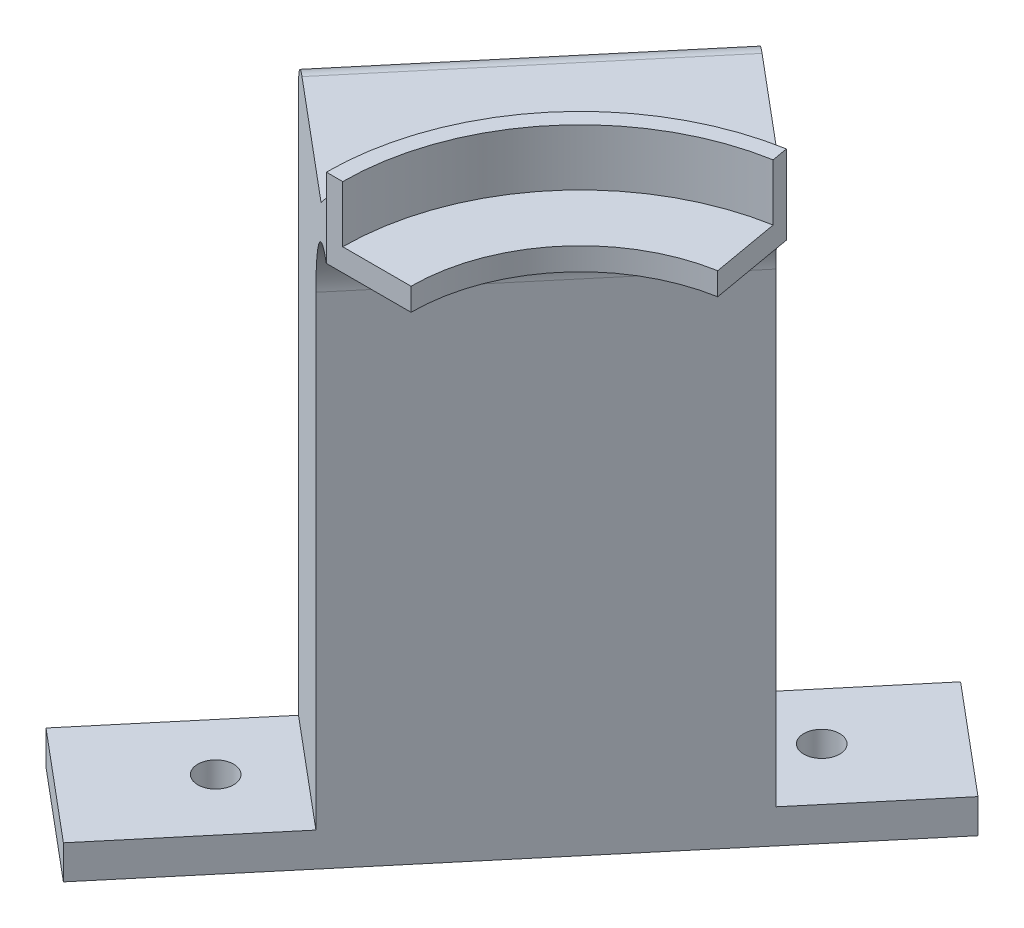
ISO-10303-21;
HEADER;
FILE_DESCRIPTION(('STEP AP214'),'2;1');
FILE_NAME('part.step','',(''),(''),'','','');
FILE_SCHEMA(('AUTOMOTIVE_DESIGN { 1 0 10303 214 1 1 1 1 }'));
ENDSEC;
DATA;
#1=APPLICATION_CONTEXT('core data for automotive mechanical design processes');
#2=APPLICATION_PROTOCOL_DEFINITION('international standard','automotive_design',2000,#1);
#3=PRODUCT_CONTEXT('',#1,'mechanical');
#4=PRODUCT('Part','Part','',(#3));
#5=PRODUCT_RELATED_PRODUCT_CATEGORY('part','',(#4));
#6=PRODUCT_DEFINITION_FORMATION('','',#4);
#7=PRODUCT_DEFINITION_CONTEXT('part definition',#1,'design');
#8=PRODUCT_DEFINITION('design','',#6,#7);
#9=PRODUCT_DEFINITION_SHAPE('','',#8);
#10=(LENGTH_UNIT() NAMED_UNIT(*) SI_UNIT(.MILLI.,.METRE.));
#11=(NAMED_UNIT(*) PLANE_ANGLE_UNIT() SI_UNIT($,.RADIAN.));
#12=(NAMED_UNIT(*) SI_UNIT($,.STERADIAN.) SOLID_ANGLE_UNIT());
#13=UNCERTAINTY_MEASURE_WITH_UNIT(LENGTH_MEASURE(1.E-05),#10,'distance_accuracy_value','');
#14=(GEOMETRIC_REPRESENTATION_CONTEXT(3) GLOBAL_UNCERTAINTY_ASSIGNED_CONTEXT((#13)) GLOBAL_UNIT_ASSIGNED_CONTEXT((#10,
#11,#12)) REPRESENTATION_CONTEXT('',''));
#15=CARTESIAN_POINT('',(0.,0.,0.));
#16=DIRECTION('',(0.,0.,1.));
#17=DIRECTION('',(1.,0.,0.));
#18=AXIS2_PLACEMENT_3D('',#15,#16,#17);
#19=CARTESIAN_POINT('',(-45.,101.490947660166,0.));
#20=DIRECTION('',(-0.642787609686541,0.,0.766044443118977));
#21=DIRECTION('',(0.766044443118977,0.,0.642787609686541));
#22=AXIS2_PLACEMENT_3D('',#19,#20,#21);
#23=PLANE('',#22);
#24=DIRECTION('',(0.,-1.,0.));
#25=VECTOR('',#24,1.);
#26=CARTESIAN_POINT('',(-75.6417777247591,101.490947660166,-25.7115043874616));
#27=LINE('',#26,#25);
#28=CARTESIAN_POINT('',(-75.6417777247591,-1.,-25.7115043874616));
#29=VERTEX_POINT('',#28);
#30=CARTESIAN_POINT('',(-75.6417777247591,-97.5,-25.7115043874616));
#31=VERTEX_POINT('',#30);
#32=EDGE_CURVE('E245',#29,#31,#27,.T.);
#33=ORIENTED_EDGE('',*,*,#32,.T.);
#34=DIRECTION('',(-0.766044443118977,0.,-0.642787609686541));
#35=VECTOR('',#34,1.);
#36=CARTESIAN_POINT('',(-56.4906666467847,-97.5,-9.64181414529811));
#37=LINE('',#36,#35);
#38=CARTESIAN_POINT('',(-56.4906666467847,-97.5,-9.64181414529811));
#39=VERTEX_POINT('',#38);
#40=EDGE_CURVE('E192',#39,#31,#37,.T.);
#41=ORIENTED_EDGE('',*,*,#40,.F.);
#42=DIRECTION('',(0.,1.,0.));
#43=VECTOR('',#42,1.);
#44=CARTESIAN_POINT('',(-56.4906666467847,-103.5,-9.64181414529812));
#45=LINE('',#44,#43);
#46=CARTESIAN_POINT('',(-56.4906666467847,-15.,-9.64181414529812));
#47=VERTEX_POINT('',#46);
#48=EDGE_CURVE('E233',#39,#47,#45,.T.);
#49=ORIENTED_EDGE('',*,*,#48,.T.);
#50=CARTESIAN_POINT('',(-45.,-15.,0.));
#51=DIRECTION('',(-0.642787609686541,0.,0.766044443118977));
#52=DIRECTION('',(0.766044443118977,0.,0.642787609686541));
#53=AXIS2_PLACEMENT_3D('',#50,#51,#52);
#54=CIRCLE('',#53,15.);
#55=CARTESIAN_POINT('',(-45.,0.,0.));
#56=VERTEX_POINT('',#55);
#57=EDGE_CURVE('E326',#47,#56,#54,.F.);
#58=ORIENTED_EDGE('',*,*,#57,.T.);
#59=DIRECTION('',(0.,-1.,0.));
#60=VECTOR('',#59,1.);
#61=CARTESIAN_POINT('',(-45.,101.490947660166,0.));
#62=LINE('',#61,#60);
#63=CARTESIAN_POINT('',(-45.,10.0000000000001,0.));
#64=VERTEX_POINT('',#63);
#65=EDGE_CURVE('E79',#64,#56,#62,.T.);
#66=ORIENTED_EDGE('',*,*,#65,.F.);
#67=CARTESIAN_POINT('',(-45.,10.0000000000001,0.));
#68=CARTESIAN_POINT('',(-45.4880326285549,9.51193638448727,-0.409507998622885));
#69=CARTESIAN_POINT('',(-45.9740151780585,9.020395405976,-0.817295776669948));
#70=CARTESIAN_POINT('',(-46.942224934509,8.03114810288744,-1.62972022620982));
#71=CARTESIAN_POINT('',(-47.42445242808,7.53344225653954,-2.03435713820875));
#72=CARTESIAN_POINT('',(-48.3855652758212,6.53258613459932,-2.84082657426816));
#73=CARTESIAN_POINT('',(-48.8644506767905,6.0294359354965,-3.24265913759772));
#74=CARTESIAN_POINT('',(-49.8192382605808,5.01823586629704,-4.04382104700881));
#75=CARTESIAN_POINT('',(-50.2951402107248,4.51018562170407,-4.44315019785117));
#76=CARTESIAN_POINT('',(-50.7696896198008,4.,-4.84134443198228));
#77=B_SPLINE_CURVE_WITH_KNOTS('',3,(#67,#68,#69,#70,#71,#72,#73,#74,#75,#76),.UNSPECIFIED.,.F.,
.F.,(4,2,2,2,4),(0.,2.4076095624587,4.81503351392388,7.22242368650531,9.62999933039969),.UNSPECIFIED.);
#78=CARTESIAN_POINT('',(-50.7696896198009,4.,-4.84134443198228));
#79=VERTEX_POINT('',#78);
#80=EDGE_CURVE('E54',#64,#79,#77,.T.);
#81=ORIENTED_EDGE('',*,*,#80,.T.);
#82=DIRECTION('',(-0.766044443118977,0.,-0.642787609686541));
#83=VECTOR('',#82,1.);
#84=CARTESIAN_POINT('',(-45.,4.,0.));
#85=LINE('',#84,#83);
#86=CARTESIAN_POINT('',(-71.8115555091642,4.,-22.4975663390289));
#87=VERTEX_POINT('',#86);
#88=EDGE_CURVE('E82',#79,#87,#85,.T.);
#89=ORIENTED_EDGE('',*,*,#88,.T.);
#90=CARTESIAN_POINT('',(-71.8115555091642,-1.,-22.4975663390289));
#91=DIRECTION('',(-0.642787609686541,0.,0.766044443118977));
#92=DIRECTION('',(0.766044443118977,0.,0.642787609686541));
#93=AXIS2_PLACEMENT_3D('',#90,#91,#92);
#94=CIRCLE('',#93,5.);
#95=EDGE_CURVE('E343',#87,#29,#94,.T.);
#96=ORIENTED_EDGE('',*,*,#95,.T.);
#97=EDGE_LOOP('',(#33,#41,#49,#58,#66,#81,#89,#96));
#98=FACE_BOUND('',#97,.T.);
#99=ADVANCED_FACE('F42',(#98),#23,.T.);
#100=CARTESIAN_POINT('',(-38.4559457197708,101.490947660166,-70.027853273011));
#101=DIRECTION('',(0.642787609686541,0.,-0.766044443118977));
#102=DIRECTION('',(-0.766044443118976,0.,-0.642787609686541));
#103=AXIS2_PLACEMENT_3D('',#100,#101,#102);
#104=PLANE('',#103);
#105=DIRECTION('',(0.,1.,0.));
#106=VECTOR('',#105,1.);
#107=CARTESIAN_POINT('',(-19.3048346417964,-103.5,-53.9581630308475));
#108=LINE('',#107,#106);
#109=CARTESIAN_POINT('',(-19.3048346417964,-97.5,-53.9581630308475));
#110=VERTEX_POINT('',#109);
#111=CARTESIAN_POINT('',(-19.3048346417964,-15.,-53.9581630308475));
#112=VERTEX_POINT('',#111);
#113=EDGE_CURVE('E236',#110,#112,#108,.T.);
#114=ORIENTED_EDGE('',*,*,#113,.F.);
#115=DIRECTION('',(0.766044443118976,0.,0.642787609686541));
#116=VECTOR('',#115,1.);
#117=CARTESIAN_POINT('',(-19.3048346417964,-97.5,-53.9581630308475));
#118=LINE('',#117,#116);
#119=CARTESIAN_POINT('',(-38.4559457197708,-97.5,-70.027853273011));
#120=VERTEX_POINT('',#119);
#121=EDGE_CURVE('E198',#120,#110,#118,.T.);
#122=ORIENTED_EDGE('',*,*,#121,.F.);
#123=DIRECTION('',(0.,-1.,0.));
#124=VECTOR('',#123,1.);
#125=CARTESIAN_POINT('',(-38.4559457197708,101.490947660166,-70.027853273011));
#126=LINE('',#125,#124);
#127=CARTESIAN_POINT('',(-38.4559457197708,-1.,-70.027853273011));
#128=VERTEX_POINT('',#127);
#129=EDGE_CURVE('E248',#128,#120,#126,.T.);
#130=ORIENTED_EDGE('',*,*,#129,.F.);
#131=CARTESIAN_POINT('',(-34.6257235041759,-1.,-66.8139152245783));
#132=DIRECTION('',(0.642787609686541,0.,-0.766044443118977));
#133=DIRECTION('',(-0.766044443118976,0.,-0.642787609686541));
#134=AXIS2_PLACEMENT_3D('',#131,#132,#133);
#135=CIRCLE('',#134,5.);
#136=CARTESIAN_POINT('',(-34.6257235041759,4.,-66.8139152245783));
#137=VERTEX_POINT('',#136);
#138=EDGE_CURVE('E337',#128,#137,#135,.T.);
#139=ORIENTED_EDGE('',*,*,#138,.T.);
#140=DIRECTION('',(0.766044443118976,0.,0.642787609686541));
#141=VECTOR('',#140,1.);
#142=CARTESIAN_POINT('',(-38.4559457197708,4.,-70.027853273011));
#143=LINE('',#142,#141);
#144=CARTESIAN_POINT('',(-13.5838576148126,4.,-49.1576933175317));
#145=VERTEX_POINT('',#144);
#146=EDGE_CURVE('E239',#137,#145,#143,.T.);
#147=ORIENTED_EDGE('',*,*,#146,.T.);
#148=CARTESIAN_POINT('',(-13.5838576148126,4.,-49.1576933175317));
#149=CARTESIAN_POINT('',(-13.1093082057365,4.51018562170407,-48.7594990834006));
#150=CARTESIAN_POINT('',(-12.6334062555925,5.01823586629704,-48.3601699325582));
#151=CARTESIAN_POINT('',(-11.6786186718022,6.0294359354965,-47.5590080231471));
#152=CARTESIAN_POINT('',(-11.1997332708329,6.53258613459932,-47.1571754598176));
#153=CARTESIAN_POINT('',(-10.2386204230917,7.53344225653954,-46.3507060237581));
#154=CARTESIAN_POINT('',(-9.75639292952074,8.03114810288743,-45.9460691117592));
#155=CARTESIAN_POINT('',(-8.78818317307022,9.020395405976,-45.1336446622193));
#156=CARTESIAN_POINT('',(-8.30220062356662,9.51193638448727,-44.7258568841723));
#157=CARTESIAN_POINT('',(-7.81416799501174,10.0000000000001,-44.3163488855494));
#158=B_SPLINE_CURVE_WITH_KNOTS('',3,(#148,#149,#150,#151,#152,#153,#154,#155,#156,#157),
.UNSPECIFIED.,.F.,.F.,(4,2,2,2,4),(0.,2.40757564389438,4.81496581647581,7.22238976794098,
9.62999933039969),.UNSPECIFIED.);
#159=CARTESIAN_POINT('',(-7.81416799501174,10.0000000000001,-44.3163488855494));
#160=VERTEX_POINT('',#159);
#161=EDGE_CURVE('E11',#145,#160,#158,.T.);
#162=ORIENTED_EDGE('',*,*,#161,.T.);
#163=DIRECTION('',(0.,-1.,0.));
#164=VECTOR('',#163,1.);
#165=CARTESIAN_POINT('',(-7.81416799501174,101.490947660166,-44.3163488855494));
#166=LINE('',#165,#164);
#167=CARTESIAN_POINT('',(-7.81416799501174,0.,-44.3163488855494));
#168=VERTEX_POINT('',#167);
#169=EDGE_CURVE('E62',#160,#168,#166,.T.);
#170=ORIENTED_EDGE('',*,*,#169,.T.);
#171=CARTESIAN_POINT('',(-7.81416799501173,-15.,-44.3163488855494));
#172=DIRECTION('',(0.642787609686541,0.,-0.766044443118977));
#173=DIRECTION('',(-0.766044443118976,0.,-0.642787609686541));
#174=AXIS2_PLACEMENT_3D('',#171,#172,#173);
#175=CIRCLE('',#174,15.);
#176=EDGE_CURVE('E329',#168,#112,#175,.F.);
#177=ORIENTED_EDGE('',*,*,#176,.T.);
#178=EDGE_LOOP('',(#114,#122,#130,#139,#147,#162,#170,#177));
#179=FACE_BOUND('',#178,.T.);
#180=ADVANCED_FACE('F367',(#179),#104,.T.);
#181=CARTESIAN_POINT('',(0.,0.,0.));
#182=DIRECTION('',(0.,1.,0.));
#183=DIRECTION('',(0.,0.,1.));
#184=AXIS2_PLACEMENT_3D('',#181,#182,#183);
#185=PLANE('',#184);
#186=DIRECTION('',(-1.,0.,0.));
#187=VECTOR('',#186,1.);
#188=CARTESIAN_POINT('',(0.,0.,0.));
#189=LINE('',#188,#187);
#190=CARTESIAN_POINT('',(-30.,0.,0.));
#191=VERTEX_POINT('',#190);
#192=EDGE_CURVE('E289',#191,#56,#189,.T.);
#193=ORIENTED_EDGE('',*,*,#192,.T.);
#194=DIRECTION('',(-0.642787609686541,0.,0.766044443118977));
#195=VECTOR('',#194,1.);
#196=CARTESIAN_POINT('',(-7.81416799501173,0.,-44.3163488855494));
#197=LINE('',#196,#195);
#198=EDGE_CURVE('E323',#56,#168,#197,.F.);
#199=ORIENTED_EDGE('',*,*,#198,.T.);
#200=DIRECTION('',(-0.173648177666928,0.,-0.984807753012209));
#201=VECTOR('',#200,1.);
#202=CARTESIAN_POINT('',(0.,0.,0.));
#203=LINE('',#202,#201);
#204=CARTESIAN_POINT('',(-5.20944533000783,0.,-29.5442325903663));
#205=VERTEX_POINT('',#204);
#206=EDGE_CURVE('E301',#205,#168,#203,.T.);
#207=ORIENTED_EDGE('',*,*,#206,.F.);
#208=CARTESIAN_POINT('',(0.,0.,0.));
#209=DIRECTION('',(0.,1.,0.));
#210=DIRECTION('',(0.,0.,1.));
#211=AXIS2_PLACEMENT_3D('',#208,#209,#210);
#212=CIRCLE('',#211,30.);
#213=EDGE_CURVE('E283',#205,#191,#212,.T.);
#214=ORIENTED_EDGE('',*,*,#213,.T.);
#215=EDGE_LOOP('',(#193,#199,#207,#214));
#216=FACE_BOUND('',#215,.T.);
#217=ADVANCED_FACE('F372',(#216),#185,.F.);
#218=CARTESIAN_POINT('',(0.,4.,0.));
#219=DIRECTION('',(0.,1.,0.));
#220=DIRECTION('',(0.,0.,1.));
#221=AXIS2_PLACEMENT_3D('',#218,#219,#220);
#222=PLANE('',#221);
#223=DIRECTION('',(-0.173648177666928,0.,-0.984807753012209));
#224=VECTOR('',#223,1.);
#225=CARTESIAN_POINT('',(0.,4.,0.));
#226=LINE('',#225,#224);
#227=CARTESIAN_POINT('',(-5.20944533000783,4.,-29.5442325903663));
#228=VERTEX_POINT('',#227);
#229=CARTESIAN_POINT('',(-7.31058827977765,4.,-41.460406401814));
#230=VERTEX_POINT('',#229);
#231=EDGE_CURVE('E288',#228,#230,#226,.T.);
#232=ORIENTED_EDGE('',*,*,#231,.T.);
#233=CARTESIAN_POINT('',(0.,4.,0.));
#234=DIRECTION('',(0.,1.,0.));
#235=DIRECTION('',(0.,0.,1.));
#236=AXIS2_PLACEMENT_3D('',#233,#234,#235);
#237=CIRCLE('',#236,42.1);
#238=CARTESIAN_POINT('',(-42.1,4.,0.));
#239=VERTEX_POINT('',#238);
#240=EDGE_CURVE('E280',#239,#230,#237,.F.);
#241=ORIENTED_EDGE('',*,*,#240,.F.);
#242=DIRECTION('',(-1.,0.,0.));
#243=VECTOR('',#242,1.);
#244=CARTESIAN_POINT('',(0.,4.,0.));
#245=LINE('',#244,#243);
#246=CARTESIAN_POINT('',(-30.,4.,0.));
#247=VERTEX_POINT('',#246);
#248=EDGE_CURVE('E293',#247,#239,#245,.T.);
#249=ORIENTED_EDGE('',*,*,#248,.F.);
#250=CARTESIAN_POINT('',(0.,4.,0.));
#251=DIRECTION('',(0.,1.,0.));
#252=DIRECTION('',(0.,0.,1.));
#253=AXIS2_PLACEMENT_3D('',#250,#251,#252);
#254=CIRCLE('',#253,30.);
#255=EDGE_CURVE('E284',#228,#247,#254,.T.);
#256=ORIENTED_EDGE('',*,*,#255,.F.);
#257=EDGE_LOOP('',(#232,#241,#249,#256));
#258=FACE_BOUND('',#257,.T.);
#259=ADVANCED_FACE('F387',(#258),#222,.T.);
#260=CARTESIAN_POINT('',(0.,4.,0.));
#261=DIRECTION('',(0.,-1.,0.));
#262=DIRECTION('',(0.,0.,-1.));
#263=AXIS2_PLACEMENT_3D('',#260,#261,#262);
#264=CYLINDRICAL_SURFACE('',#263,30.);
#265=ORIENTED_EDGE('',*,*,#213,.F.);
#266=DIRECTION('',(0.,-1.,0.));
#267=VECTOR('',#266,1.);
#268=CARTESIAN_POINT('',(-5.20944533000783,4.,-29.5442325903663));
#269=LINE('',#268,#267);
#270=EDGE_CURVE('E316',#228,#205,#269,.T.);
#271=ORIENTED_EDGE('',*,*,#270,.F.);
#272=ORIENTED_EDGE('',*,*,#255,.T.);
#273=DIRECTION('',(0.,-1.,0.));
#274=VECTOR('',#273,1.);
#275=CARTESIAN_POINT('',(-30.,4.,0.));
#276=LINE('',#275,#274);
#277=EDGE_CURVE('E297',#247,#191,#276,.T.);
#278=ORIENTED_EDGE('',*,*,#277,.T.);
#279=EDGE_LOOP('',(#265,#271,#272,#278));
#280=FACE_BOUND('',#279,.T.);
#281=ADVANCED_FACE('F390',(#280),#264,.F.);
#282=CARTESIAN_POINT('',(0.,4.,0.));
#283=DIRECTION('',(-0.984807753012209,0.,0.173648177666928));
#284=DIRECTION('',(0.173648177666928,0.,0.984807753012209));
#285=AXIS2_PLACEMENT_3D('',#282,#283,#284);
#286=PLANE('',#285);
#287=ORIENTED_EDGE('',*,*,#206,.T.);
#288=ORIENTED_EDGE('',*,*,#169,.F.);
#289=DIRECTION('',(0.,-1.,0.));
#290=VECTOR('',#289,1.);
#291=CARTESIAN_POINT('',(-7.81416799501174,4.,-44.3163488855494));
#292=LINE('',#291,#290);
#293=CARTESIAN_POINT('',(-7.81416799501174,14.,-44.3163488855494));
#294=VERTEX_POINT('',#293);
#295=EDGE_CURVE('E313',#294,#160,#292,.T.);
#296=ORIENTED_EDGE('',*,*,#295,.F.);
#297=DIRECTION('',(-0.173648177666928,0.,-0.984807753012209));
#298=VECTOR('',#297,1.);
#299=CARTESIAN_POINT('',(0.,14.,0.));
#300=LINE('',#299,#298);
#301=CARTESIAN_POINT('',(-7.31058827977765,14.,-41.460406401814));
#302=VERTEX_POINT('',#301);
#303=EDGE_CURVE('E256',#302,#294,#300,.T.);
#304=ORIENTED_EDGE('',*,*,#303,.F.);
#305=DIRECTION('',(0.,-1.,0.));
#306=VECTOR('',#305,1.);
#307=CARTESIAN_POINT('',(-7.31058827977765,14.,-41.460406401814));
#308=LINE('',#307,#306);
#309=EDGE_CURVE('E272',#302,#230,#308,.T.);
#310=ORIENTED_EDGE('',*,*,#309,.T.);
#311=ORIENTED_EDGE('',*,*,#231,.F.);
#312=ORIENTED_EDGE('',*,*,#270,.T.);
#313=EDGE_LOOP('',(#287,#288,#296,#304,#310,#311,#312));
#314=FACE_BOUND('',#313,.T.);
#315=ADVANCED_FACE('F401',(#314),#286,.F.);
#316=CARTESIAN_POINT('',(0.,4.,0.));
#317=DIRECTION('',(0.,-1.,0.));
#318=DIRECTION('',(0.,0.,-1.));
#319=AXIS2_PLACEMENT_3D('',#316,#317,#318);
#320=CYLINDRICAL_SURFACE('',#319,45.);
#321=ORIENTED_EDGE('',*,*,#295,.T.);
#322=CARTESIAN_POINT('',(0.,10.0000000000001,0.));
#323=DIRECTION('',(0.,1.,0.));
#324=DIRECTION('',(0.,0.,1.));
#325=AXIS2_PLACEMENT_3D('',#322,#323,#324);
#326=CIRCLE('',#325,45.);
#327=EDGE_CURVE('E346',#160,#64,#326,.T.);
#328=ORIENTED_EDGE('',*,*,#327,.T.);
#329=DIRECTION('',(0.,-1.,0.));
#330=VECTOR('',#329,1.);
#331=CARTESIAN_POINT('',(-45.,4.,0.));
#332=LINE('',#331,#330);
#333=CARTESIAN_POINT('',(-45.,14.,0.));
#334=VERTEX_POINT('',#333);
#335=EDGE_CURVE('E309',#334,#64,#332,.T.);
#336=ORIENTED_EDGE('',*,*,#335,.F.);
#337=CARTESIAN_POINT('',(0.,14.,0.));
#338=DIRECTION('',(0.,1.,0.));
#339=DIRECTION('',(0.,0.,1.));
#340=AXIS2_PLACEMENT_3D('',#337,#338,#339);
#341=CIRCLE('',#340,45.);
#342=EDGE_CURVE('E260',#294,#334,#341,.T.);
#343=ORIENTED_EDGE('',*,*,#342,.F.);
#344=EDGE_LOOP('',(#321,#328,#336,#343));
#345=FACE_BOUND('',#344,.T.);
#346=ADVANCED_FACE('F397',(#345),#320,.T.);
#347=CARTESIAN_POINT('',(0.,4.,0.));
#348=DIRECTION('',(0.,0.,1.));
#349=DIRECTION('',(1.,0.,0.));
#350=AXIS2_PLACEMENT_3D('',#347,#348,#349);
#351=PLANE('',#350);
#352=ORIENTED_EDGE('',*,*,#248,.T.);
#353=DIRECTION('',(0.,-1.,0.));
#354=VECTOR('',#353,1.);
#355=CARTESIAN_POINT('',(-42.1,14.,0.));
#356=LINE('',#355,#354);
#357=CARTESIAN_POINT('',(-42.1,14.,0.));
#358=VERTEX_POINT('',#357);
#359=EDGE_CURVE('E276',#358,#239,#356,.T.);
#360=ORIENTED_EDGE('',*,*,#359,.F.);
#361=DIRECTION('',(-1.,0.,0.));
#362=VECTOR('',#361,1.);
#363=CARTESIAN_POINT('',(0.,14.,0.));
#364=LINE('',#363,#362);
#365=EDGE_CURVE('E264',#358,#334,#364,.T.);
#366=ORIENTED_EDGE('',*,*,#365,.T.);
#367=ORIENTED_EDGE('',*,*,#335,.T.);
#368=ORIENTED_EDGE('',*,*,#65,.T.);
#369=ORIENTED_EDGE('',*,*,#192,.F.);
#370=ORIENTED_EDGE('',*,*,#277,.F.);
#371=EDGE_LOOP('',(#352,#360,#366,#367,#368,#369,#370));
#372=FACE_BOUND('',#371,.T.);
#373=ADVANCED_FACE('F385',(#372),#351,.T.);
#374=CARTESIAN_POINT('',(0.,14.,0.));
#375=DIRECTION('',(0.,-1.,0.));
#376=DIRECTION('',(0.,0.,-1.));
#377=AXIS2_PLACEMENT_3D('',#374,#375,#376);
#378=CYLINDRICAL_SURFACE('',#377,42.1);
#379=ORIENTED_EDGE('',*,*,#359,.T.);
#380=ORIENTED_EDGE('',*,*,#240,.T.);
#381=ORIENTED_EDGE('',*,*,#309,.F.);
#382=CARTESIAN_POINT('',(0.,14.,0.));
#383=DIRECTION('',(0.,1.,0.));
#384=DIRECTION('',(0.,0.,1.));
#385=AXIS2_PLACEMENT_3D('',#382,#383,#384);
#386=CIRCLE('',#385,42.1);
#387=EDGE_CURVE('E268',#302,#358,#386,.T.);
#388=ORIENTED_EDGE('',*,*,#387,.T.);
#389=EDGE_LOOP('',(#379,#380,#381,#388));
#390=FACE_BOUND('',#389,.T.);
#391=ADVANCED_FACE('F381',(#390),#378,.F.);
#392=CARTESIAN_POINT('',(0.,14.,0.));
#393=DIRECTION('',(0.,1.,0.));
#394=DIRECTION('',(0.,0.,1.));
#395=AXIS2_PLACEMENT_3D('',#392,#393,#394);
#396=PLANE('',#395);
#397=ORIENTED_EDGE('',*,*,#303,.T.);
#398=ORIENTED_EDGE('',*,*,#342,.T.);
#399=ORIENTED_EDGE('',*,*,#365,.F.);
#400=ORIENTED_EDGE('',*,*,#387,.F.);
#401=EDGE_LOOP('',(#397,#398,#399,#400));
#402=FACE_BOUND('',#401,.T.);
#403=ADVANCED_FACE('F377',(#402),#396,.T.);
#404=CARTESIAN_POINT('',(0.,4.,0.));
#405=DIRECTION('',(0.,1.,0.));
#406=DIRECTION('',(0.,0.,1.));
#407=AXIS2_PLACEMENT_3D('',#404,#405,#406);
#408=PLANE('',#407);
#409=ORIENTED_EDGE('',*,*,#88,.F.);
#410=CARTESIAN_POINT('',(0.,4.,0.));
#411=DIRECTION('',(0.,1.,0.));
#412=DIRECTION('',(0.,0.,1.));
#413=AXIS2_PLACEMENT_3D('',#410,#411,#412);
#414=CIRCLE('',#413,51.);
#415=EDGE_CURVE('E350',#79,#145,#414,.F.);
#416=ORIENTED_EDGE('',*,*,#415,.T.);
#417=ORIENTED_EDGE('',*,*,#146,.F.);
#418=DIRECTION('',(0.642787609686541,0.,-0.766044443118977));
#419=VECTOR('',#418,1.);
#420=CARTESIAN_POINT('',(-53.2186395066701,4.,-44.6557407818036));
#421=LINE('',#420,#419);
#422=EDGE_CURVE('E340',#137,#87,#421,.F.);
#423=ORIENTED_EDGE('',*,*,#422,.T.);
#424=EDGE_LOOP('',(#409,#416,#417,#423));
#425=FACE_BOUND('',#424,.T.);
#426=ADVANCED_FACE('F374',(#425),#408,.T.);
#427=CARTESIAN_POINT('',(-75.6417777247591,101.490947660166,-25.7115043874616));
#428=DIRECTION('',(-0.766044443118977,0.,-0.642787609686541));
#429=DIRECTION('',(-0.642787609686541,0.,0.766044443118977));
#430=AXIS2_PLACEMENT_3D('',#427,#428,#429);
#431=PLANE('',#430);
#432=ORIENTED_EDGE('',*,*,#32,.F.);
#433=DIRECTION('',(0.642787609686541,0.,-0.766044443118977));
#434=VECTOR('',#433,1.);
#435=CARTESIAN_POINT('',(-75.6417777247591,-1.,-25.7115043874616));
#436=LINE('',#435,#434);
#437=EDGE_CURVE('E333',#29,#128,#436,.T.);
#438=ORIENTED_EDGE('',*,*,#437,.T.);
#439=ORIENTED_EDGE('',*,*,#129,.T.);
#440=DIRECTION('',(-0.642787609686541,0.,0.766044443118976));
#441=VECTOR('',#440,1.);
#442=CARTESIAN_POINT('',(-22.1291404337327,-97.5,-89.4853821282331));
#443=LINE('',#442,#441);
#444=CARTESIAN_POINT('',(-22.1291404337327,-97.5,-89.4853821282331));
#445=VERTEX_POINT('',#444);
#446=EDGE_CURVE('E225',#445,#120,#443,.T.);
#447=ORIENTED_EDGE('',*,*,#446,.F.);
#448=DIRECTION('',(0.,1.,0.));
#449=VECTOR('',#448,1.);
#450=CARTESIAN_POINT('',(-22.1291404337327,-103.5,-89.4853821282331));
#451=LINE('',#450,#449);
#452=CARTESIAN_POINT('',(-22.1291404337327,-103.5,-89.4853821282331));
#453=VERTEX_POINT('',#452);
#454=EDGE_CURVE('E215',#453,#445,#451,.T.);
#455=ORIENTED_EDGE('',*,*,#454,.F.);
#456=DIRECTION('',(0.642787609686541,0.,-0.766044443118977));
#457=VECTOR('',#456,1.);
#458=CARTESIAN_POINT('',(-75.6417777247591,-103.5,-25.7115043874616));
#459=LINE('',#458,#457);
#460=CARTESIAN_POINT('',(-96.0502843323067,-103.5,-1.38959331843411));
#461=VERTEX_POINT('',#460);
#462=EDGE_CURVE('E177',#461,#453,#459,.T.);
#463=ORIENTED_EDGE('',*,*,#462,.F.);
#464=DIRECTION('',(0.,-1.,0.));
#465=VECTOR('',#464,1.);
#466=CARTESIAN_POINT('',(-96.0502843323067,-97.5,-1.38959331843411));
#467=LINE('',#466,#465);
#468=CARTESIAN_POINT('',(-96.0502843323067,-97.5,-1.38959331843411));
#469=VERTEX_POINT('',#468);
#470=EDGE_CURVE('E169',#469,#461,#467,.T.);
#471=ORIENTED_EDGE('',*,*,#470,.F.);
#472=DIRECTION('',(0.642787609686541,0.,-0.766044443118977));
#473=VECTOR('',#472,1.);
#474=CARTESIAN_POINT('',(-96.0502843323067,-97.5,-1.38959331843411));
#475=LINE('',#474,#473);
#476=EDGE_CURVE('E174',#469,#31,#475,.T.);
#477=ORIENTED_EDGE('',*,*,#476,.T.);
#478=EDGE_LOOP('',(#432,#438,#439,#447,#455,#463,#471,#477));
#479=FACE_BOUND('',#478,.T.);
#480=ADVANCED_FACE('F172',(#479),#431,.T.);
#481=CARTESIAN_POINT('',(-19.3048346417964,-103.5,-53.9581630308475));
#482=DIRECTION('',(-0.766044443118977,0.,-0.642787609686541));
#483=DIRECTION('',(-0.642787609686541,0.,0.766044443118977));
#484=AXIS2_PLACEMENT_3D('',#481,#482,#483);
#485=PLANE('',#484);
#486=DIRECTION('',(-0.642787609686541,0.,0.766044443118977));
#487=VECTOR('',#486,1.);
#488=CARTESIAN_POINT('',(-19.3048346417964,-103.5,-53.9581630308475));
#489=LINE('',#488,#487);
#490=CARTESIAN_POINT('',(-2.97802935575824,-103.5,-73.4156918860695));
#491=VERTEX_POINT('',#490);
#492=CARTESIAN_POINT('',(-76.8991732543323,-103.5,14.6800969237294));
#493=VERTEX_POINT('',#492);
#494=EDGE_CURVE('E230',#491,#493,#489,.T.);
#495=ORIENTED_EDGE('',*,*,#494,.F.);
#496=DIRECTION('',(0.,-1.,0.));
#497=VECTOR('',#496,1.);
#498=CARTESIAN_POINT('',(-2.97802935575824,-103.5,-73.4156918860695));
#499=LINE('',#498,#497);
#500=CARTESIAN_POINT('',(-2.97802935575824,-97.5,-73.4156918860695));
#501=VERTEX_POINT('',#500);
#502=EDGE_CURVE('E203',#501,#491,#499,.T.);
#503=ORIENTED_EDGE('',*,*,#502,.F.);
#504=DIRECTION('',(-0.642787609686541,0.,0.766044443118976));
#505=VECTOR('',#504,1.);
#506=CARTESIAN_POINT('',(-2.97802935575824,-97.5,-73.4156918860695));
#507=LINE('',#506,#505);
#508=EDGE_CURVE('E220',#501,#110,#507,.T.);
#509=ORIENTED_EDGE('',*,*,#508,.T.);
#510=ORIENTED_EDGE('',*,*,#113,.T.);
#511=DIRECTION('',(-0.642787609686541,0.,0.766044443118977));
#512=VECTOR('',#511,1.);
#513=CARTESIAN_POINT('',(-56.4906666467847,-15.,-9.64181414529812));
#514=LINE('',#513,#512);
#515=EDGE_CURVE('E319',#112,#47,#514,.T.);
#516=ORIENTED_EDGE('',*,*,#515,.T.);
#517=ORIENTED_EDGE('',*,*,#48,.F.);
#518=DIRECTION('',(0.642787609686541,0.,-0.766044443118977));
#519=VECTOR('',#518,1.);
#520=CARTESIAN_POINT('',(-76.8991732543323,-97.5,14.6800969237294));
#521=LINE('',#520,#519);
#522=CARTESIAN_POINT('',(-76.8991732543323,-97.5,14.6800969237294));
#523=VERTEX_POINT('',#522);
#524=EDGE_CURVE('E199',#523,#39,#521,.T.);
#525=ORIENTED_EDGE('',*,*,#524,.F.);
#526=DIRECTION('',(0.,1.,0.));
#527=VECTOR('',#526,1.);
#528=CARTESIAN_POINT('',(-76.8991732543323,-103.5,14.6800969237294));
#529=LINE('',#528,#527);
#530=EDGE_CURVE('E188',#493,#523,#529,.T.);
#531=ORIENTED_EDGE('',*,*,#530,.F.);
#532=EDGE_LOOP('',(#495,#503,#509,#510,#516,#517,#525,#531));
#533=FACE_BOUND('',#532,.T.);
#534=ADVANCED_FACE('F433',(#533),#485,.F.);
#535=CARTESIAN_POINT('',(0.,-103.5,0.));
#536=DIRECTION('',(0.,-1.,0.));
#537=DIRECTION('',(0.,0.,-1.));
#538=AXIS2_PLACEMENT_3D('',#535,#536,#537);
#539=PLANE('',#538);
#540=CARTESIAN_POINT('',(-73.8894813564539,-103.5,-9.29198815349686));
#541=DIRECTION('',(0.,-1.,0.));
#542=DIRECTION('',(0.,0.,-1.));
#543=AXIS2_PLACEMENT_3D('',#540,#541,#542);
#544=CIRCLE('',#543,3.175);
#545=CARTESIAN_POINT('',(-73.8894813564539,-103.5,-12.4669881534969));
#546=VERTEX_POINT('',#545);
#547=EDGE_CURVE('E450',#546,#546,#544,.T.);
#548=ORIENTED_EDGE('',*,*,#547,.F.);
#549=EDGE_LOOP('',(#548));
#550=FACE_BOUND('',#549,.T.);
#551=CARTESIAN_POINT('',(-24.9090654983395,-103.5,-67.6645747191629));
#552=DIRECTION('',(0.,-1.,0.));
#553=DIRECTION('',(0.,0.,-1.));
#554=AXIS2_PLACEMENT_3D('',#551,#552,#553);
#555=CIRCLE('',#554,3.175);
#556=CARTESIAN_POINT('',(-24.9090654983395,-103.5,-70.8395747191629));
#557=VERTEX_POINT('',#556);
#558=EDGE_CURVE('E455',#557,#557,#555,.T.);
#559=ORIENTED_EDGE('',*,*,#558,.F.);
#560=EDGE_LOOP('',(#559));
#561=FACE_BOUND('',#560,.T.);
#562=ORIENTED_EDGE('',*,*,#462,.T.);
#563=DIRECTION('',(-0.766044443118976,0.,-0.642787609686541));
#564=VECTOR('',#563,1.);
#565=CARTESIAN_POINT('',(-2.97802935575824,-103.5,-73.4156918860695));
#566=LINE('',#565,#564);
#567=EDGE_CURVE('E211',#491,#453,#566,.T.);
#568=ORIENTED_EDGE('',*,*,#567,.F.);
#569=ORIENTED_EDGE('',*,*,#494,.T.);
#570=DIRECTION('',(0.766044443118977,0.,0.642787609686541));
#571=VECTOR('',#570,1.);
#572=CARTESIAN_POINT('',(-96.0502843323067,-103.5,-1.38959331843411));
#573=LINE('',#572,#571);
#574=EDGE_CURVE('E182',#461,#493,#573,.T.);
#575=ORIENTED_EDGE('',*,*,#574,.F.);
#576=EDGE_LOOP('',(#562,#568,#569,#575));
#577=FACE_BOUND('',#576,.T.);
#578=ADVANCED_FACE('F411',(#550,#561,#577),#539,.T.);
#579=CARTESIAN_POINT('',(-7.81416799501172,-15.,-44.3163488855494));
#580=DIRECTION('',(0.642787609686541,0.,-0.766044443118977));
#581=DIRECTION('',(-0.766044443118977,0.,-0.642787609686541));
#582=AXIS2_PLACEMENT_3D('',#579,#580,#581);
#583=CYLINDRICAL_SURFACE('',#582,15.);
#584=ORIENTED_EDGE('',*,*,#176,.F.);
#585=ORIENTED_EDGE('',*,*,#198,.F.);
#586=ORIENTED_EDGE('',*,*,#57,.F.);
#587=ORIENTED_EDGE('',*,*,#515,.F.);
#588=EDGE_LOOP('',(#584,#585,#586,#587));
#589=FACE_BOUND('',#588,.T.);
#590=ADVANCED_FACE('F408',(#589),#583,.F.);
#591=CARTESIAN_POINT('',(-71.8115555091642,-1.,-22.4975663390289));
#592=DIRECTION('',(0.642787609686541,0.,-0.766044443118977));
#593=DIRECTION('',(-0.766044443118977,0.,-0.642787609686541));
#594=AXIS2_PLACEMENT_3D('',#591,#592,#593);
#595=CYLINDRICAL_SURFACE('',#594,5.);
#596=ORIENTED_EDGE('',*,*,#95,.F.);
#597=ORIENTED_EDGE('',*,*,#422,.F.);
#598=ORIENTED_EDGE('',*,*,#138,.F.);
#599=ORIENTED_EDGE('',*,*,#437,.F.);
#600=EDGE_LOOP('',(#596,#597,#598,#599));
#601=FACE_BOUND('',#600,.T.);
#602=ADVANCED_FACE('F410',(#601),#595,.T.);
#603=CARTESIAN_POINT('',(0.,10.0000000000001,0.));
#604=DIRECTION('',(0.,-1.,0.));
#605=DIRECTION('',(0.,0.,-1.));
#606=AXIS2_PLACEMENT_3D('',#603,#604,#605);
#607=CONICAL_SURFACE('',#606,45.,0.785398163397442);
#608=ORIENTED_EDGE('',*,*,#161,.F.);
#609=ORIENTED_EDGE('',*,*,#415,.F.);
#610=ORIENTED_EDGE('',*,*,#80,.F.);
#611=ORIENTED_EDGE('',*,*,#327,.F.);
#612=EDGE_LOOP('',(#608,#609,#610,#611));
#613=FACE_BOUND('',#612,.T.);
#614=ADVANCED_FACE('F45',(#613),#607,.T.);
#615=CARTESIAN_POINT('',(-2.97802935575824,-97.5,-73.4156918860695));
#616=DIRECTION('',(0.,-1.,0.));
#617=DIRECTION('',(0.,0.,-1.));
#618=AXIS2_PLACEMENT_3D('',#615,#616,#617);
#619=PLANE('',#618);
#620=CARTESIAN_POINT('',(-24.9090654983395,-97.5,-67.6645747191629));
#621=DIRECTION('',(0.,-1.,0.));
#622=DIRECTION('',(0.,0.,-1.));
#623=AXIS2_PLACEMENT_3D('',#620,#621,#622);
#624=CIRCLE('',#623,3.175);
#625=CARTESIAN_POINT('',(-24.9090654983395,-97.5,-70.8395747191629));
#626=VERTEX_POINT('',#625);
#627=EDGE_CURVE('E48',#626,#626,#624,.T.);
#628=ORIENTED_EDGE('',*,*,#627,.T.);
#629=EDGE_LOOP('',(#628));
#630=FACE_BOUND('',#629,.T.);
#631=ORIENTED_EDGE('',*,*,#121,.T.);
#632=ORIENTED_EDGE('',*,*,#508,.F.);
#633=DIRECTION('',(0.766044443118976,0.,0.642787609686541));
#634=VECTOR('',#633,1.);
#635=CARTESIAN_POINT('',(-2.97802935575824,-97.5,-73.4156918860695));
#636=LINE('',#635,#634);
#637=EDGE_CURVE('E218',#445,#501,#636,.T.);
#638=ORIENTED_EDGE('',*,*,#637,.F.);
#639=ORIENTED_EDGE('',*,*,#446,.T.);
#640=EDGE_LOOP('',(#631,#632,#638,#639));
#641=FACE_BOUND('',#640,.T.);
#642=ADVANCED_FACE('F418',(#630,#641),#619,.F.);
#643=CARTESIAN_POINT('',(34.9197212885323,0.,-41.6157032979967));
#644=DIRECTION('',(-0.642787609686541,0.,0.766044443118976));
#645=DIRECTION('',(0.766044443118976,0.,0.642787609686541));
#646=AXIS2_PLACEMENT_3D('',#643,#644,#645);
#647=PLANE('',#646);
#648=ORIENTED_EDGE('',*,*,#502,.T.);
#649=ORIENTED_EDGE('',*,*,#567,.T.);
#650=ORIENTED_EDGE('',*,*,#454,.T.);
#651=ORIENTED_EDGE('',*,*,#637,.T.);
#652=EDGE_LOOP('',(#648,#649,#650,#651));
#653=FACE_BOUND('',#652,.T.);
#654=ADVANCED_FACE('F436',(#653),#647,.F.);
#655=CARTESIAN_POINT('',(-76.8991732543323,-97.5,14.6800969237294));
#656=DIRECTION('',(0.,-1.,0.));
#657=DIRECTION('',(0.,0.,-1.));
#658=AXIS2_PLACEMENT_3D('',#655,#656,#657);
#659=PLANE('',#658);
#660=CARTESIAN_POINT('',(-73.8894813564539,-97.5,-9.29198815349686));
#661=DIRECTION('',(0.,-1.,0.));
#662=DIRECTION('',(0.,0.,-1.));
#663=AXIS2_PLACEMENT_3D('',#660,#661,#662);
#664=CIRCLE('',#663,3.175);
#665=CARTESIAN_POINT('',(-73.8894813564539,-97.5,-12.4669881534969));
#666=VERTEX_POINT('',#665);
#667=EDGE_CURVE('E445',#666,#666,#664,.T.);
#668=ORIENTED_EDGE('',*,*,#667,.T.);
#669=EDGE_LOOP('',(#668));
#670=FACE_BOUND('',#669,.T.);
#671=ORIENTED_EDGE('',*,*,#40,.T.);
#672=ORIENTED_EDGE('',*,*,#476,.F.);
#673=DIRECTION('',(-0.766044443118977,0.,-0.642787609686541));
#674=VECTOR('',#673,1.);
#675=CARTESIAN_POINT('',(-76.8991732543323,-97.5,14.6800969237294));
#676=LINE('',#675,#674);
#677=EDGE_CURVE('E183',#523,#469,#676,.T.);
#678=ORIENTED_EDGE('',*,*,#677,.F.);
#679=ORIENTED_EDGE('',*,*,#524,.T.);
#680=EDGE_LOOP('',(#671,#672,#678,#679));
#681=FACE_BOUND('',#680,.T.);
#682=ADVANCED_FACE('F194',(#670,#681),#659,.F.);
#683=CARTESIAN_POINT('',(-39.0014226100418,0.,46.4800855118022));
#684=DIRECTION('',(-0.642787609686541,0.,0.766044443118977));
#685=DIRECTION('',(0.766044443118977,0.,0.642787609686541));
#686=AXIS2_PLACEMENT_3D('',#683,#684,#685);
#687=PLANE('',#686);
#688=ORIENTED_EDGE('',*,*,#677,.T.);
#689=ORIENTED_EDGE('',*,*,#470,.T.);
#690=ORIENTED_EDGE('',*,*,#574,.T.);
#691=ORIENTED_EDGE('',*,*,#530,.T.);
#692=EDGE_LOOP('',(#688,#689,#690,#691));
#693=FACE_BOUND('',#692,.T.);
#694=ADVANCED_FACE('F186',(#693),#687,.T.);
#695=CARTESIAN_POINT('',(-73.8894813564539,-78.1,-9.29198815349686));
#696=DIRECTION('',(0.,-1.,0.));
#697=DIRECTION('',(0.,0.,-1.));
#698=AXIS2_PLACEMENT_3D('',#695,#696,#697);
#699=CYLINDRICAL_SURFACE('',#698,3.175);
#700=ORIENTED_EDGE('',*,*,#547,.T.);
#701=EDGE_LOOP('',(#700));
#702=FACE_BOUND('',#701,.T.);
#703=ORIENTED_EDGE('',*,*,#667,.F.);
#704=EDGE_LOOP('',(#703));
#705=FACE_BOUND('',#704,.T.);
#706=ADVANCED_FACE('F482',(#702,#705),#699,.F.);
#707=CARTESIAN_POINT('',(-24.9090654983395,-78.1,-67.6645747191629));
#708=DIRECTION('',(0.,-1.,0.));
#709=DIRECTION('',(0.,0.,-1.));
#710=AXIS2_PLACEMENT_3D('',#707,#708,#709);
#711=CYLINDRICAL_SURFACE('',#710,3.175);
#712=ORIENTED_EDGE('',*,*,#558,.T.);
#713=EDGE_LOOP('',(#712));
#714=FACE_BOUND('',#713,.T.);
#715=ORIENTED_EDGE('',*,*,#627,.F.);
#716=EDGE_LOOP('',(#715));
#717=FACE_BOUND('',#716,.T.);
#718=ADVANCED_FACE('F464',(#714,#717),#711,.F.);
#719=CLOSED_SHELL('',(#99,#180,#217,#259,#281,#315,#346,#373,#391,#403,#426,#480,#534,#578,#590,
#602,#614,#642,#654,#682,#694,#706,#718));
#720=MANIFOLD_SOLID_BREP('B2',#719);
#721=ADVANCED_BREP_SHAPE_REPRESENTATION('',(#18,#720),#14);
#722=SHAPE_DEFINITION_REPRESENTATION(#9,#721);
ENDSEC;
END-ISO-10303-21;
